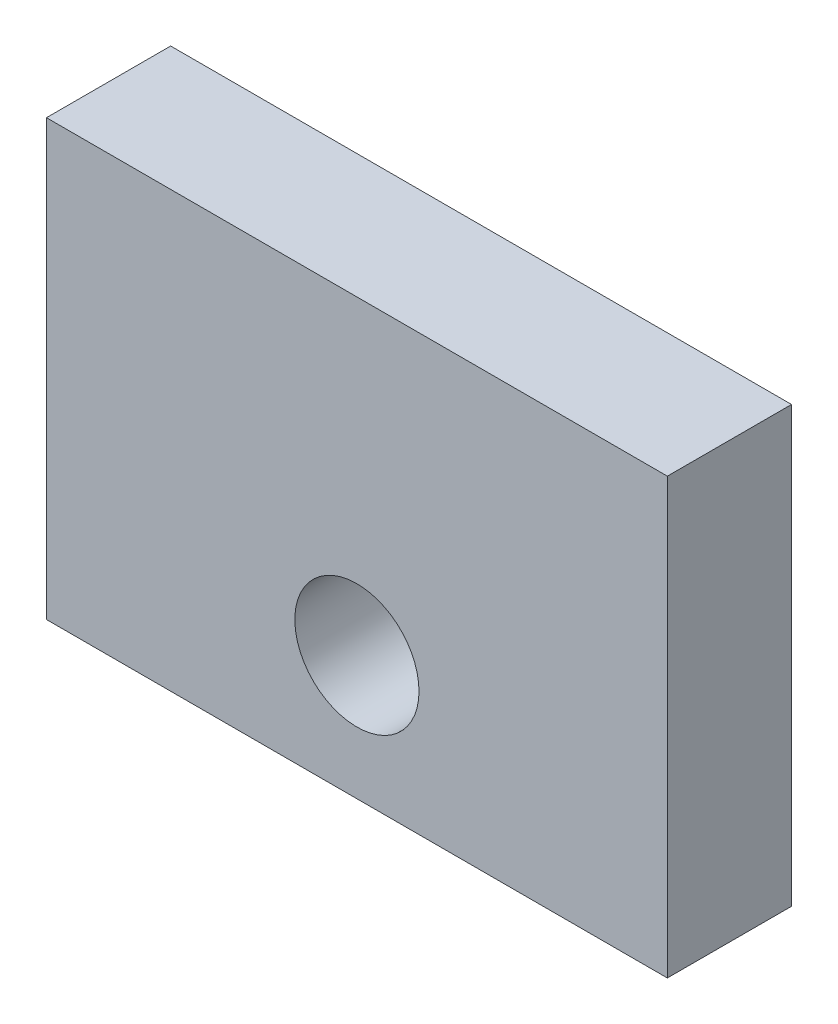
ISO-10303-21;
HEADER;
FILE_DESCRIPTION(('STEP AP214'),'2;1');
FILE_NAME('part.step','',(''),(''),'','','');
FILE_SCHEMA(('AUTOMOTIVE_DESIGN { 1 0 10303 214 1 1 1 1 }'));
ENDSEC;
DATA;
#1=APPLICATION_CONTEXT('core data for automotive mechanical design processes');
#2=APPLICATION_PROTOCOL_DEFINITION('international standard','automotive_design',2000,#1);
#3=PRODUCT_CONTEXT('',#1,'mechanical');
#4=PRODUCT('Part','Part','',(#3));
#5=PRODUCT_RELATED_PRODUCT_CATEGORY('part','',(#4));
#6=PRODUCT_DEFINITION_FORMATION('','',#4);
#7=PRODUCT_DEFINITION_CONTEXT('part definition',#1,'design');
#8=PRODUCT_DEFINITION('design','',#6,#7);
#9=PRODUCT_DEFINITION_SHAPE('','',#8);
#10=(LENGTH_UNIT() NAMED_UNIT(*) SI_UNIT(.MILLI.,.METRE.));
#11=(NAMED_UNIT(*) PLANE_ANGLE_UNIT() SI_UNIT($,.RADIAN.));
#12=(NAMED_UNIT(*) SI_UNIT($,.STERADIAN.) SOLID_ANGLE_UNIT());
#13=UNCERTAINTY_MEASURE_WITH_UNIT(LENGTH_MEASURE(1.E-05),#10,'distance_accuracy_value','');
#14=(GEOMETRIC_REPRESENTATION_CONTEXT(3) GLOBAL_UNCERTAINTY_ASSIGNED_CONTEXT((#13)) GLOBAL_UNIT_ASSIGNED_CONTEXT((#10,
#11,#12)) REPRESENTATION_CONTEXT('',''));
#15=CARTESIAN_POINT('',(0.,0.,0.));
#16=DIRECTION('',(0.,0.,1.));
#17=DIRECTION('',(1.,0.,0.));
#18=AXIS2_PLACEMENT_3D('',#15,#16,#17);
#19=CARTESIAN_POINT('',(0.,0.,2.));
#20=DIRECTION('',(0.,0.,-1.));
#21=DIRECTION('',(-1.,0.,0.));
#22=AXIS2_PLACEMENT_3D('',#19,#20,#21);
#23=PLANE('',#22);
#24=DIRECTION('',(0.,-1.,0.));
#25=VECTOR('',#24,1.);
#26=CARTESIAN_POINT('',(0.,0.,2.));
#27=LINE('',#26,#25);
#28=CARTESIAN_POINT('',(0.,7.,2.));
#29=VERTEX_POINT('',#28);
#30=CARTESIAN_POINT('',(0.,0.,2.));
#31=VERTEX_POINT('',#30);
#32=EDGE_CURVE('E85',#29,#31,#27,.T.);
#33=ORIENTED_EDGE('',*,*,#32,.T.);
#34=DIRECTION('',(1.,0.,0.));
#35=VECTOR('',#34,1.);
#36=CARTESIAN_POINT('',(0.,0.,2.));
#37=LINE('',#36,#35);
#38=CARTESIAN_POINT('',(9.99999999999999,0.,2.));
#39=VERTEX_POINT('',#38);
#40=EDGE_CURVE('E80',#31,#39,#37,.T.);
#41=ORIENTED_EDGE('',*,*,#40,.T.);
#42=DIRECTION('',(0.,1.,0.));
#43=VECTOR('',#42,1.);
#44=CARTESIAN_POINT('',(9.99999999999999,0.,2.));
#45=LINE('',#44,#43);
#46=CARTESIAN_POINT('',(10.,7.,2.));
#47=VERTEX_POINT('',#46);
#48=EDGE_CURVE('E83',#39,#47,#45,.T.);
#49=ORIENTED_EDGE('',*,*,#48,.T.);
#50=DIRECTION('',(-1.,0.,0.));
#51=VECTOR('',#50,1.);
#52=CARTESIAN_POINT('',(0.,7.,2.));
#53=LINE('',#52,#51);
#54=EDGE_CURVE('E50',#47,#29,#53,.T.);
#55=ORIENTED_EDGE('',*,*,#54,.T.);
#56=EDGE_LOOP('',(#33,#41,#49,#55));
#57=FACE_BOUND('',#56,.T.);
#58=CARTESIAN_POINT('',(5.,2.,2.));
#59=DIRECTION('',(0.,0.,1.));
#60=DIRECTION('',(1.,0.,0.));
#61=AXIS2_PLACEMENT_3D('',#58,#59,#60);
#62=CIRCLE('',#61,1.);
#63=CARTESIAN_POINT('',(6.,2.,2.));
#64=VERTEX_POINT('',#63);
#65=EDGE_CURVE('E100',#64,#64,#62,.T.);
#66=ORIENTED_EDGE('',*,*,#65,.F.);
#67=EDGE_LOOP('',(#66));
#68=FACE_BOUND('',#67,.T.);
#69=ADVANCED_FACE('F33',(#57,#68),#23,.F.);
#70=CARTESIAN_POINT('',(0.,0.,0.));
#71=DIRECTION('',(0.,0.,-1.));
#72=DIRECTION('',(-1.,0.,0.));
#73=AXIS2_PLACEMENT_3D('',#70,#71,#72);
#74=PLANE('',#73);
#75=DIRECTION('',(0.,-1.,0.));
#76=VECTOR('',#75,1.);
#77=CARTESIAN_POINT('',(0.,0.,0.));
#78=LINE('',#77,#76);
#79=CARTESIAN_POINT('',(0.,7.,0.));
#80=VERTEX_POINT('',#79);
#81=CARTESIAN_POINT('',(0.,0.,0.));
#82=VERTEX_POINT('',#81);
#83=EDGE_CURVE('E97',#80,#82,#78,.T.);
#84=ORIENTED_EDGE('',*,*,#83,.F.);
#85=DIRECTION('',(-1.,0.,0.));
#86=VECTOR('',#85,1.);
#87=CARTESIAN_POINT('',(0.,7.,0.));
#88=LINE('',#87,#86);
#89=CARTESIAN_POINT('',(10.,7.,0.));
#90=VERTEX_POINT('',#89);
#91=EDGE_CURVE('E73',#90,#80,#88,.T.);
#92=ORIENTED_EDGE('',*,*,#91,.F.);
#93=DIRECTION('',(0.,1.,0.));
#94=VECTOR('',#93,1.);
#95=CARTESIAN_POINT('',(9.99999999999999,0.,0.));
#96=LINE('',#95,#94);
#97=CARTESIAN_POINT('',(9.99999999999999,0.,0.));
#98=VERTEX_POINT('',#97);
#99=EDGE_CURVE('E67',#98,#90,#96,.T.);
#100=ORIENTED_EDGE('',*,*,#99,.F.);
#101=DIRECTION('',(1.,0.,0.));
#102=VECTOR('',#101,1.);
#103=CARTESIAN_POINT('',(0.,0.,0.));
#104=LINE('',#103,#102);
#105=EDGE_CURVE('E89',#82,#98,#104,.T.);
#106=ORIENTED_EDGE('',*,*,#105,.F.);
#107=EDGE_LOOP('',(#84,#92,#100,#106));
#108=FACE_BOUND('',#107,.T.);
#109=CARTESIAN_POINT('',(5.,2.,0.));
#110=DIRECTION('',(0.,0.,1.));
#111=DIRECTION('',(1.,0.,0.));
#112=AXIS2_PLACEMENT_3D('',#109,#110,#111);
#113=CIRCLE('',#112,1.);
#114=CARTESIAN_POINT('',(6.,2.,0.));
#115=VERTEX_POINT('',#114);
#116=EDGE_CURVE('E112',#115,#115,#113,.T.);
#117=ORIENTED_EDGE('',*,*,#116,.T.);
#118=EDGE_LOOP('',(#117));
#119=FACE_BOUND('',#118,.T.);
#120=ADVANCED_FACE('F108',(#108,#119),#74,.T.);
#121=CARTESIAN_POINT('',(0.,0.,2.));
#122=DIRECTION('',(1.,0.,0.));
#123=DIRECTION('',(0.,0.,-1.));
#124=AXIS2_PLACEMENT_3D('',#121,#122,#123);
#125=PLANE('',#124);
#126=ORIENTED_EDGE('',*,*,#83,.T.);
#127=DIRECTION('',(0.,0.,-1.));
#128=VECTOR('',#127,1.);
#129=CARTESIAN_POINT('',(0.,0.,2.));
#130=LINE('',#129,#128);
#131=EDGE_CURVE('E11',#31,#82,#130,.T.);
#132=ORIENTED_EDGE('',*,*,#131,.F.);
#133=ORIENTED_EDGE('',*,*,#32,.F.);
#134=DIRECTION('',(0.,0.,-1.));
#135=VECTOR('',#134,1.);
#136=CARTESIAN_POINT('',(0.,7.,2.));
#137=LINE('',#136,#135);
#138=EDGE_CURVE('E93',#29,#80,#137,.T.);
#139=ORIENTED_EDGE('',*,*,#138,.T.);
#140=EDGE_LOOP('',(#126,#132,#133,#139));
#141=FACE_BOUND('',#140,.T.);
#142=ADVANCED_FACE('F35',(#141),#125,.F.);
#143=CARTESIAN_POINT('',(0.,0.,2.));
#144=DIRECTION('',(0.,1.,0.));
#145=DIRECTION('',(0.,0.,1.));
#146=AXIS2_PLACEMENT_3D('',#143,#144,#145);
#147=PLANE('',#146);
#148=ORIENTED_EDGE('',*,*,#105,.T.);
#149=DIRECTION('',(0.,0.,-1.));
#150=VECTOR('',#149,1.);
#151=CARTESIAN_POINT('',(9.99999999999999,0.,2.));
#152=LINE('',#151,#150);
#153=EDGE_CURVE('E42',#39,#98,#152,.T.);
#154=ORIENTED_EDGE('',*,*,#153,.F.);
#155=ORIENTED_EDGE('',*,*,#40,.F.);
#156=ORIENTED_EDGE('',*,*,#131,.T.);
#157=EDGE_LOOP('',(#148,#154,#155,#156));
#158=FACE_BOUND('',#157,.T.);
#159=ADVANCED_FACE('F88',(#158),#147,.F.);
#160=CARTESIAN_POINT('',(9.99999999999999,0.,2.));
#161=DIRECTION('',(-1.,0.,0.));
#162=DIRECTION('',(0.,-1.,0.));
#163=AXIS2_PLACEMENT_3D('',#160,#161,#162);
#164=PLANE('',#163);
#165=ORIENTED_EDGE('',*,*,#99,.T.);
#166=DIRECTION('',(0.,0.,-1.));
#167=VECTOR('',#166,1.);
#168=CARTESIAN_POINT('',(10.,7.,2.));
#169=LINE('',#168,#167);
#170=EDGE_CURVE('E90',#47,#90,#169,.T.);
#171=ORIENTED_EDGE('',*,*,#170,.F.);
#172=ORIENTED_EDGE('',*,*,#48,.F.);
#173=ORIENTED_EDGE('',*,*,#153,.T.);
#174=EDGE_LOOP('',(#165,#171,#172,#173));
#175=FACE_BOUND('',#174,.T.);
#176=ADVANCED_FACE('F91',(#175),#164,.F.);
#177=CARTESIAN_POINT('',(0.,7.,2.));
#178=DIRECTION('',(0.,-1.,0.));
#179=DIRECTION('',(0.,0.,-1.));
#180=AXIS2_PLACEMENT_3D('',#177,#178,#179);
#181=PLANE('',#180);
#182=ORIENTED_EDGE('',*,*,#91,.T.);
#183=ORIENTED_EDGE('',*,*,#138,.F.);
#184=ORIENTED_EDGE('',*,*,#54,.F.);
#185=ORIENTED_EDGE('',*,*,#170,.T.);
#186=EDGE_LOOP('',(#182,#183,#184,#185));
#187=FACE_BOUND('',#186,.T.);
#188=ADVANCED_FACE('F105',(#187),#181,.F.);
#189=CARTESIAN_POINT('',(5.,2.,2.));
#190=DIRECTION('',(0.,0.,-1.));
#191=DIRECTION('',(-1.,0.,0.));
#192=AXIS2_PLACEMENT_3D('',#189,#190,#191);
#193=CYLINDRICAL_SURFACE('',#192,1.);
#194=ORIENTED_EDGE('',*,*,#65,.T.);
#195=EDGE_LOOP('',(#194));
#196=FACE_BOUND('',#195,.T.);
#197=ORIENTED_EDGE('',*,*,#116,.F.);
#198=EDGE_LOOP('',(#197));
#199=FACE_BOUND('',#198,.T.);
#200=ADVANCED_FACE('F118',(#196,#199),#193,.F.);
#201=CLOSED_SHELL('',(#69,#120,#142,#159,#176,#188,#200));
#202=MANIFOLD_SOLID_BREP('B2',#201);
#203=ADVANCED_BREP_SHAPE_REPRESENTATION('',(#18,#202),#14);
#204=SHAPE_DEFINITION_REPRESENTATION(#9,#203);
ENDSEC;
END-ISO-10303-21;
